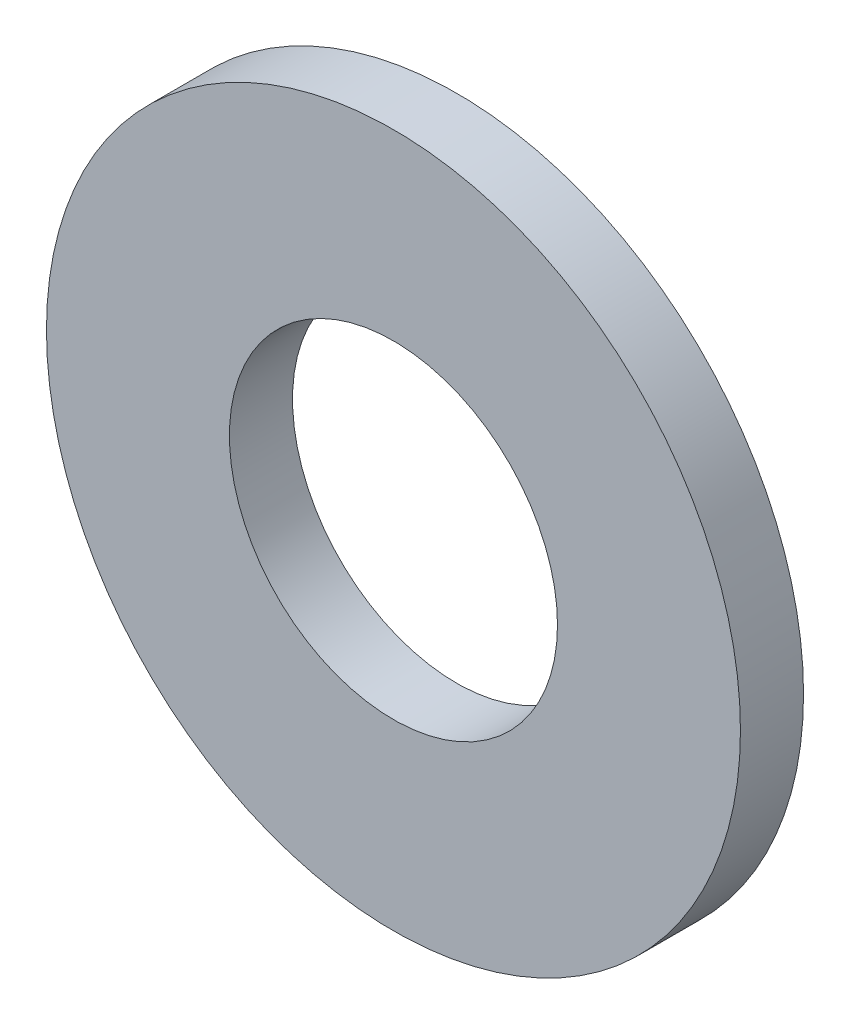
ISO-10303-21;
HEADER;
FILE_DESCRIPTION(('STEP AP214'),'2;1');
FILE_NAME('part.step','',(''),(''),'','','');
FILE_SCHEMA(('AUTOMOTIVE_DESIGN { 1 0 10303 214 1 1 1 1 }'));
ENDSEC;
DATA;
#1=APPLICATION_CONTEXT('core data for automotive mechanical design processes');
#2=APPLICATION_PROTOCOL_DEFINITION('international standard','automotive_design',2000,#1);
#3=PRODUCT_CONTEXT('',#1,'mechanical');
#4=PRODUCT('Part','Part','',(#3));
#5=PRODUCT_RELATED_PRODUCT_CATEGORY('part','',(#4));
#6=PRODUCT_DEFINITION_FORMATION('','',#4);
#7=PRODUCT_DEFINITION_CONTEXT('part definition',#1,'design');
#8=PRODUCT_DEFINITION('design','',#6,#7);
#9=PRODUCT_DEFINITION_SHAPE('','',#8);
#10=(LENGTH_UNIT() NAMED_UNIT(*) SI_UNIT(.MILLI.,.METRE.));
#11=(NAMED_UNIT(*) PLANE_ANGLE_UNIT() SI_UNIT($,.RADIAN.));
#12=(NAMED_UNIT(*) SI_UNIT($,.STERADIAN.) SOLID_ANGLE_UNIT());
#13=UNCERTAINTY_MEASURE_WITH_UNIT(LENGTH_MEASURE(1.E-05),#10,'distance_accuracy_value','');
#14=(GEOMETRIC_REPRESENTATION_CONTEXT(3) GLOBAL_UNCERTAINTY_ASSIGNED_CONTEXT((#13)) GLOBAL_UNIT_ASSIGNED_CONTEXT((#10,
#11,#12)) REPRESENTATION_CONTEXT('',''));
#15=CARTESIAN_POINT('',(0.,0.,0.));
#16=DIRECTION('',(0.,0.,1.));
#17=DIRECTION('',(1.,0.,0.));
#18=AXIS2_PLACEMENT_3D('',#15,#16,#17);
#19=CARTESIAN_POINT('',(0.,0.,1.));
#20=DIRECTION('',(0.,0.,1.));
#21=DIRECTION('',(1.,0.,0.));
#22=AXIS2_PLACEMENT_3D('',#19,#20,#21);
#23=PLANE('',#22);
#24=CARTESIAN_POINT('',(0.,0.,1.));
#25=DIRECTION('',(0.,0.,1.));
#26=DIRECTION('',(1.,0.,0.));
#27=AXIS2_PLACEMENT_3D('',#24,#25,#26);
#28=CIRCLE('',#27,5.5);
#29=CARTESIAN_POINT('',(5.5,0.,1.));
#30=VERTEX_POINT('',#29);
#31=EDGE_CURVE('E10',#30,#30,#28,.T.);
#32=ORIENTED_EDGE('',*,*,#31,.T.);
#33=EDGE_LOOP('',(#32));
#34=FACE_BOUND('',#33,.T.);
#35=CARTESIAN_POINT('',(0.,0.,1.));
#36=DIRECTION('',(0.,0.,1.));
#37=DIRECTION('',(1.,0.,0.));
#38=AXIS2_PLACEMENT_3D('',#35,#36,#37);
#39=CIRCLE('',#38,2.6);
#40=CARTESIAN_POINT('',(2.6,0.,1.));
#41=VERTEX_POINT('',#40);
#42=EDGE_CURVE('E42',#41,#41,#39,.T.);
#43=ORIENTED_EDGE('',*,*,#42,.F.);
#44=EDGE_LOOP('',(#43));
#45=FACE_BOUND('',#44,.T.);
#46=ADVANCED_FACE('F31',(#34,#45),#23,.T.);
#47=CARTESIAN_POINT('',(0.,0.,0.));
#48=DIRECTION('',(0.,0.,1.));
#49=DIRECTION('',(1.,0.,0.));
#50=AXIS2_PLACEMENT_3D('',#47,#48,#49);
#51=PLANE('',#50);
#52=CARTESIAN_POINT('',(0.,0.,0.));
#53=DIRECTION('',(0.,0.,1.));
#54=DIRECTION('',(1.,0.,0.));
#55=AXIS2_PLACEMENT_3D('',#52,#53,#54);
#56=CIRCLE('',#55,5.5);
#57=CARTESIAN_POINT('',(5.5,0.,0.));
#58=VERTEX_POINT('',#57);
#59=EDGE_CURVE('E35',#58,#58,#56,.T.);
#60=ORIENTED_EDGE('',*,*,#59,.F.);
#61=EDGE_LOOP('',(#60));
#62=FACE_BOUND('',#61,.T.);
#63=CARTESIAN_POINT('',(0.,0.,0.));
#64=DIRECTION('',(0.,0.,1.));
#65=DIRECTION('',(1.,0.,0.));
#66=AXIS2_PLACEMENT_3D('',#63,#64,#65);
#67=CIRCLE('',#66,2.6);
#68=CARTESIAN_POINT('',(2.6,0.,0.));
#69=VERTEX_POINT('',#68);
#70=EDGE_CURVE('E44',#69,#69,#67,.T.);
#71=ORIENTED_EDGE('',*,*,#70,.T.);
#72=EDGE_LOOP('',(#71));
#73=FACE_BOUND('',#72,.T.);
#74=ADVANCED_FACE('F54',(#62,#73),#51,.F.);
#75=CARTESIAN_POINT('',(0.,0.,1.));
#76=DIRECTION('',(0.,0.,-1.));
#77=DIRECTION('',(-1.,0.,0.));
#78=AXIS2_PLACEMENT_3D('',#75,#76,#77);
#79=CYLINDRICAL_SURFACE('',#78,5.5);
#80=ORIENTED_EDGE('',*,*,#31,.F.);
#81=EDGE_LOOP('',(#80));
#82=FACE_BOUND('',#81,.T.);
#83=ORIENTED_EDGE('',*,*,#59,.T.);
#84=EDGE_LOOP('',(#83));
#85=FACE_BOUND('',#84,.T.);
#86=ADVANCED_FACE('F33',(#82,#85),#79,.T.);
#87=CARTESIAN_POINT('',(0.,0.,1.));
#88=DIRECTION('',(0.,0.,-1.));
#89=DIRECTION('',(-1.,0.,0.));
#90=AXIS2_PLACEMENT_3D('',#87,#88,#89);
#91=CYLINDRICAL_SURFACE('',#90,2.6);
#92=ORIENTED_EDGE('',*,*,#42,.T.);
#93=EDGE_LOOP('',(#92));
#94=FACE_BOUND('',#93,.T.);
#95=ORIENTED_EDGE('',*,*,#70,.F.);
#96=EDGE_LOOP('',(#95));
#97=FACE_BOUND('',#96,.T.);
#98=ADVANCED_FACE('F50',(#94,#97),#91,.F.);
#99=CLOSED_SHELL('',(#46,#74,#86,#98));
#100=MANIFOLD_SOLID_BREP('B2',#99);
#101=ADVANCED_BREP_SHAPE_REPRESENTATION('',(#18,#100),#14);
#102=SHAPE_DEFINITION_REPRESENTATION(#9,#101);
ENDSEC;
END-ISO-10303-21;
